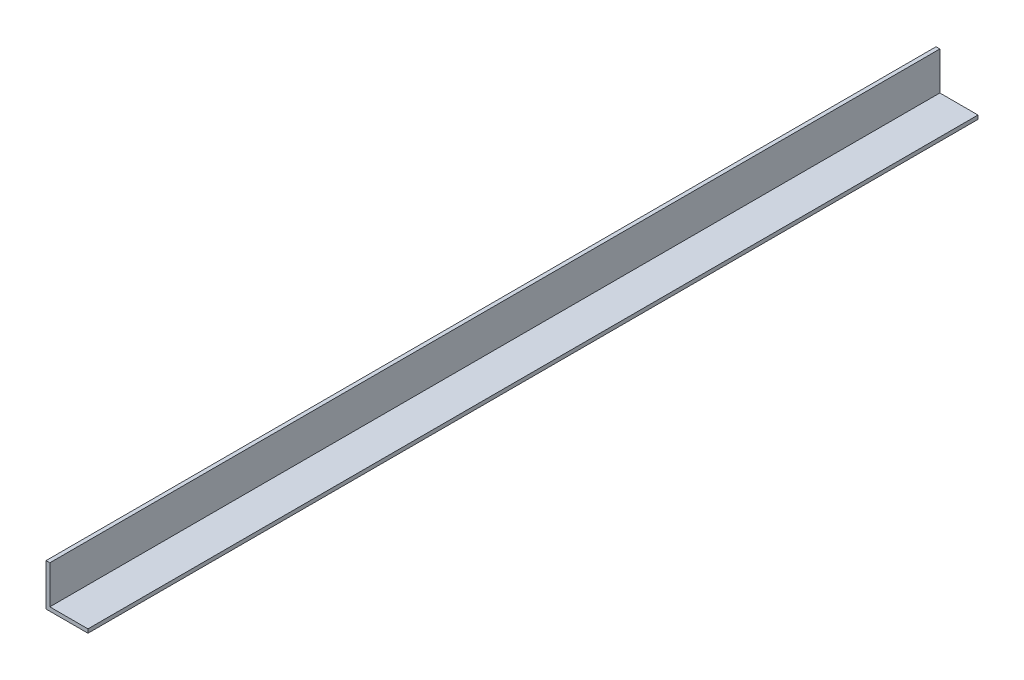
ISO-10303-21;
HEADER;
FILE_DESCRIPTION(('STEP AP214'),'2;1');
FILE_NAME('part.step','',(''),(''),'','','');
FILE_SCHEMA(('AUTOMOTIVE_DESIGN { 1 0 10303 214 1 1 1 1 }'));
ENDSEC;
DATA;
#1=APPLICATION_CONTEXT('core data for automotive mechanical design processes');
#2=APPLICATION_PROTOCOL_DEFINITION('international standard','automotive_design',2000,#1);
#3=PRODUCT_CONTEXT('',#1,'mechanical');
#4=PRODUCT('Part','Part','',(#3));
#5=PRODUCT_RELATED_PRODUCT_CATEGORY('part','',(#4));
#6=PRODUCT_DEFINITION_FORMATION('','',#4);
#7=PRODUCT_DEFINITION_CONTEXT('part definition',#1,'design');
#8=PRODUCT_DEFINITION('design','',#6,#7);
#9=PRODUCT_DEFINITION_SHAPE('','',#8);
#10=(LENGTH_UNIT() NAMED_UNIT(*) SI_UNIT(.MILLI.,.METRE.));
#11=(NAMED_UNIT(*) PLANE_ANGLE_UNIT() SI_UNIT($,.RADIAN.));
#12=(NAMED_UNIT(*) SI_UNIT($,.STERADIAN.) SOLID_ANGLE_UNIT());
#13=UNCERTAINTY_MEASURE_WITH_UNIT(LENGTH_MEASURE(1.E-05),#10,'distance_accuracy_value','');
#14=(GEOMETRIC_REPRESENTATION_CONTEXT(3) GLOBAL_UNCERTAINTY_ASSIGNED_CONTEXT((#13)) GLOBAL_UNIT_ASSIGNED_CONTEXT((#10,
#11,#12)) REPRESENTATION_CONTEXT('',''));
#15=CARTESIAN_POINT('',(0.,0.,0.));
#16=DIRECTION('',(0.,0.,1.));
#17=DIRECTION('',(1.,0.,0.));
#18=AXIS2_PLACEMENT_3D('',#15,#16,#17);
#19=CARTESIAN_POINT('',(0.,-3.,700.));
#20=DIRECTION('',(0.,1.,0.));
#21=DIRECTION('',(0.,0.,1.));
#22=AXIS2_PLACEMENT_3D('',#19,#20,#21);
#23=PLANE('',#22);
#24=DIRECTION('',(1.,0.,0.));
#25=VECTOR('',#24,1.);
#26=CARTESIAN_POINT('',(0.,-3.,0.));
#27=LINE('',#26,#25);
#28=CARTESIAN_POINT('',(-3.,-3.,0.));
#29=VERTEX_POINT('',#28);
#30=CARTESIAN_POINT('',(30.,-3.,0.));
#31=VERTEX_POINT('',#30);
#32=EDGE_CURVE('E118',#29,#31,#27,.T.);
#33=ORIENTED_EDGE('',*,*,#32,.T.);
#34=DIRECTION('',(0.,0.,-1.));
#35=VECTOR('',#34,1.);
#36=CARTESIAN_POINT('',(30.,-3.,700.));
#37=LINE('',#36,#35);
#38=CARTESIAN_POINT('',(30.,-3.,700.));
#39=VERTEX_POINT('',#38);
#40=EDGE_CURVE('E11',#39,#31,#37,.T.);
#41=ORIENTED_EDGE('',*,*,#40,.F.);
#42=DIRECTION('',(1.,0.,0.));
#43=VECTOR('',#42,1.);
#44=CARTESIAN_POINT('',(0.,-3.,700.));
#45=LINE('',#44,#43);
#46=CARTESIAN_POINT('',(-3.,-3.,700.));
#47=VERTEX_POINT('',#46);
#48=EDGE_CURVE('E83',#47,#39,#45,.T.);
#49=ORIENTED_EDGE('',*,*,#48,.F.);
#50=DIRECTION('',(0.,0.,-1.));
#51=VECTOR('',#50,1.);
#52=CARTESIAN_POINT('',(-3.,-3.,700.));
#53=LINE('',#52,#51);
#54=EDGE_CURVE('E114',#47,#29,#53,.T.);
#55=ORIENTED_EDGE('',*,*,#54,.T.);
#56=EDGE_LOOP('',(#33,#41,#49,#55));
#57=FACE_BOUND('',#56,.T.);
#58=ADVANCED_FACE('F37',(#57),#23,.F.);
#59=CARTESIAN_POINT('',(30.,0.,700.));
#60=DIRECTION('',(1.,0.,0.));
#61=DIRECTION('',(0.,0.,-1.));
#62=AXIS2_PLACEMENT_3D('',#59,#60,#61);
#63=PLANE('',#62);
#64=DIRECTION('',(0.,-1.,0.));
#65=VECTOR('',#64,1.);
#66=CARTESIAN_POINT('',(30.,0.,0.));
#67=LINE('',#66,#65);
#68=CARTESIAN_POINT('',(30.,0.,0.));
#69=VERTEX_POINT('',#68);
#70=EDGE_CURVE('E121',#69,#31,#67,.T.);
#71=ORIENTED_EDGE('',*,*,#70,.F.);
#72=DIRECTION('',(0.,0.,-1.));
#73=VECTOR('',#72,1.);
#74=CARTESIAN_POINT('',(30.,0.,700.));
#75=LINE('',#74,#73);
#76=CARTESIAN_POINT('',(30.,0.,700.));
#77=VERTEX_POINT('',#76);
#78=EDGE_CURVE('E45',#77,#69,#75,.T.);
#79=ORIENTED_EDGE('',*,*,#78,.F.);
#80=DIRECTION('',(0.,-1.,0.));
#81=VECTOR('',#80,1.);
#82=CARTESIAN_POINT('',(30.,0.,700.));
#83=LINE('',#82,#81);
#84=EDGE_CURVE('E223',#77,#39,#83,.T.);
#85=ORIENTED_EDGE('',*,*,#84,.T.);
#86=ORIENTED_EDGE('',*,*,#40,.T.);
#87=EDGE_LOOP('',(#71,#79,#85,#86));
#88=FACE_BOUND('',#87,.T.);
#89=ADVANCED_FACE('F139',(#88),#63,.T.);
#90=CARTESIAN_POINT('',(0.,0.,700.));
#91=DIRECTION('',(0.,1.,0.));
#92=DIRECTION('',(0.,0.,1.));
#93=AXIS2_PLACEMENT_3D('',#90,#91,#92);
#94=PLANE('',#93);
#95=DIRECTION('',(1.,0.,0.));
#96=VECTOR('',#95,1.);
#97=CARTESIAN_POINT('',(0.,0.,0.));
#98=LINE('',#97,#96);
#99=CARTESIAN_POINT('',(0.,0.,0.));
#100=VERTEX_POINT('',#99);
#101=EDGE_CURVE('E124',#100,#69,#98,.T.);
#102=ORIENTED_EDGE('',*,*,#101,.F.);
#103=DIRECTION('',(0.,0.,-1.));
#104=VECTOR('',#103,1.);
#105=CARTESIAN_POINT('',(0.,0.,700.));
#106=LINE('',#105,#104);
#107=CARTESIAN_POINT('',(0.,0.,700.));
#108=VERTEX_POINT('',#107);
#109=EDGE_CURVE('E104',#108,#100,#106,.T.);
#110=ORIENTED_EDGE('',*,*,#109,.F.);
#111=DIRECTION('',(1.,0.,0.));
#112=VECTOR('',#111,1.);
#113=CARTESIAN_POINT('',(0.,0.,700.));
#114=LINE('',#113,#112);
#115=EDGE_CURVE('E110',#108,#77,#114,.T.);
#116=ORIENTED_EDGE('',*,*,#115,.T.);
#117=ORIENTED_EDGE('',*,*,#78,.T.);
#118=EDGE_LOOP('',(#102,#110,#116,#117));
#119=FACE_BOUND('',#118,.T.);
#120=ADVANCED_FACE('F136',(#119),#94,.T.);
#121=CARTESIAN_POINT('',(0.,30.,700.));
#122=DIRECTION('',(1.,0.,0.));
#123=DIRECTION('',(0.,1.,0.));
#124=AXIS2_PLACEMENT_3D('',#121,#122,#123);
#125=PLANE('',#124);
#126=DIRECTION('',(0.,-1.,0.));
#127=VECTOR('',#126,1.);
#128=CARTESIAN_POINT('',(0.,30.,0.));
#129=LINE('',#128,#127);
#130=CARTESIAN_POINT('',(0.,30.,0.));
#131=VERTEX_POINT('',#130);
#132=EDGE_CURVE('E99',#131,#100,#129,.T.);
#133=ORIENTED_EDGE('',*,*,#132,.F.);
#134=DIRECTION('',(0.,0.,-1.));
#135=VECTOR('',#134,1.);
#136=CARTESIAN_POINT('',(0.,30.,700.));
#137=LINE('',#136,#135);
#138=CARTESIAN_POINT('',(0.,30.,700.));
#139=VERTEX_POINT('',#138);
#140=EDGE_CURVE('E94',#139,#131,#137,.T.);
#141=ORIENTED_EDGE('',*,*,#140,.F.);
#142=DIRECTION('',(0.,-1.,0.));
#143=VECTOR('',#142,1.);
#144=CARTESIAN_POINT('',(0.,30.,700.));
#145=LINE('',#144,#143);
#146=EDGE_CURVE('E97',#139,#108,#145,.T.);
#147=ORIENTED_EDGE('',*,*,#146,.T.);
#148=ORIENTED_EDGE('',*,*,#109,.T.);
#149=EDGE_LOOP('',(#133,#141,#147,#148));
#150=FACE_BOUND('',#149,.T.);
#151=ADVANCED_FACE('F96',(#150),#125,.T.);
#152=CARTESIAN_POINT('',(-3.,30.,700.));
#153=DIRECTION('',(0.,1.,0.));
#154=DIRECTION('',(0.,0.,1.));
#155=AXIS2_PLACEMENT_3D('',#152,#153,#154);
#156=PLANE('',#155);
#157=DIRECTION('',(1.,0.,0.));
#158=VECTOR('',#157,1.);
#159=CARTESIAN_POINT('',(-3.,30.,0.));
#160=LINE('',#159,#158);
#161=CARTESIAN_POINT('',(-3.,30.,0.));
#162=VERTEX_POINT('',#161);
#163=EDGE_CURVE('E128',#162,#131,#160,.T.);
#164=ORIENTED_EDGE('',*,*,#163,.F.);
#165=DIRECTION('',(0.,0.,-1.));
#166=VECTOR('',#165,1.);
#167=CARTESIAN_POINT('',(-3.,30.,700.));
#168=LINE('',#167,#166);
#169=CARTESIAN_POINT('',(-3.,30.,700.));
#170=VERTEX_POINT('',#169);
#171=EDGE_CURVE('E74',#170,#162,#168,.T.);
#172=ORIENTED_EDGE('',*,*,#171,.F.);
#173=DIRECTION('',(1.,0.,0.));
#174=VECTOR('',#173,1.);
#175=CARTESIAN_POINT('',(-3.,30.,700.));
#176=LINE('',#175,#174);
#177=EDGE_CURVE('E108',#170,#139,#176,.T.);
#178=ORIENTED_EDGE('',*,*,#177,.T.);
#179=ORIENTED_EDGE('',*,*,#140,.T.);
#180=EDGE_LOOP('',(#164,#172,#178,#179));
#181=FACE_BOUND('',#180,.T.);
#182=ADVANCED_FACE('F112',(#181),#156,.T.);
#183=CARTESIAN_POINT('',(-3.,30.,700.));
#184=DIRECTION('',(1.,0.,0.));
#185=DIRECTION('',(0.,1.,0.));
#186=AXIS2_PLACEMENT_3D('',#183,#184,#185);
#187=PLANE('',#186);
#188=DIRECTION('',(0.,-1.,0.));
#189=VECTOR('',#188,1.);
#190=CARTESIAN_POINT('',(-3.,30.,0.));
#191=LINE('',#190,#189);
#192=EDGE_CURVE('E77',#162,#29,#191,.T.);
#193=ORIENTED_EDGE('',*,*,#192,.T.);
#194=ORIENTED_EDGE('',*,*,#54,.F.);
#195=DIRECTION('',(0.,-1.,0.));
#196=VECTOR('',#195,1.);
#197=CARTESIAN_POINT('',(-3.,30.,700.));
#198=LINE('',#197,#196);
#199=EDGE_CURVE('E53',#170,#47,#198,.T.);
#200=ORIENTED_EDGE('',*,*,#199,.F.);
#201=ORIENTED_EDGE('',*,*,#171,.T.);
#202=EDGE_LOOP('',(#193,#194,#200,#201));
#203=FACE_BOUND('',#202,.T.);
#204=ADVANCED_FACE('F144',(#203),#187,.F.);
#205=CARTESIAN_POINT('',(0.,0.,700.));
#206=DIRECTION('',(0.,0.,-1.));
#207=DIRECTION('',(-1.,0.,0.));
#208=AXIS2_PLACEMENT_3D('',#205,#206,#207);
#209=PLANE('',#208);
#210=ORIENTED_EDGE('',*,*,#48,.T.);
#211=ORIENTED_EDGE('',*,*,#84,.F.);
#212=ORIENTED_EDGE('',*,*,#115,.F.);
#213=ORIENTED_EDGE('',*,*,#146,.F.);
#214=ORIENTED_EDGE('',*,*,#177,.F.);
#215=ORIENTED_EDGE('',*,*,#199,.T.);
#216=EDGE_LOOP('',(#210,#211,#212,#213,#214,#215));
#217=FACE_BOUND('',#216,.T.);
#218=ADVANCED_FACE('F107',(#217),#209,.F.);
#219=CARTESIAN_POINT('',(0.,0.,0.));
#220=DIRECTION('',(0.,0.,-1.));
#221=DIRECTION('',(-1.,0.,0.));
#222=AXIS2_PLACEMENT_3D('',#219,#220,#221);
#223=PLANE('',#222);
#224=ORIENTED_EDGE('',*,*,#32,.F.);
#225=ORIENTED_EDGE('',*,*,#192,.F.);
#226=ORIENTED_EDGE('',*,*,#163,.T.);
#227=ORIENTED_EDGE('',*,*,#132,.T.);
#228=ORIENTED_EDGE('',*,*,#101,.T.);
#229=ORIENTED_EDGE('',*,*,#70,.T.);
#230=EDGE_LOOP('',(#224,#225,#226,#227,#228,#229));
#231=FACE_BOUND('',#230,.T.);
#232=ADVANCED_FACE('F142',(#231),#223,.T.);
#233=CLOSED_SHELL('',(#58,#89,#120,#151,#182,#204,#218,#232));
#234=MANIFOLD_SOLID_BREP('B2',#233);
#235=ADVANCED_BREP_SHAPE_REPRESENTATION('',(#18,#234),#14);
#236=SHAPE_DEFINITION_REPRESENTATION(#9,#235);
ENDSEC;
END-ISO-10303-21;
